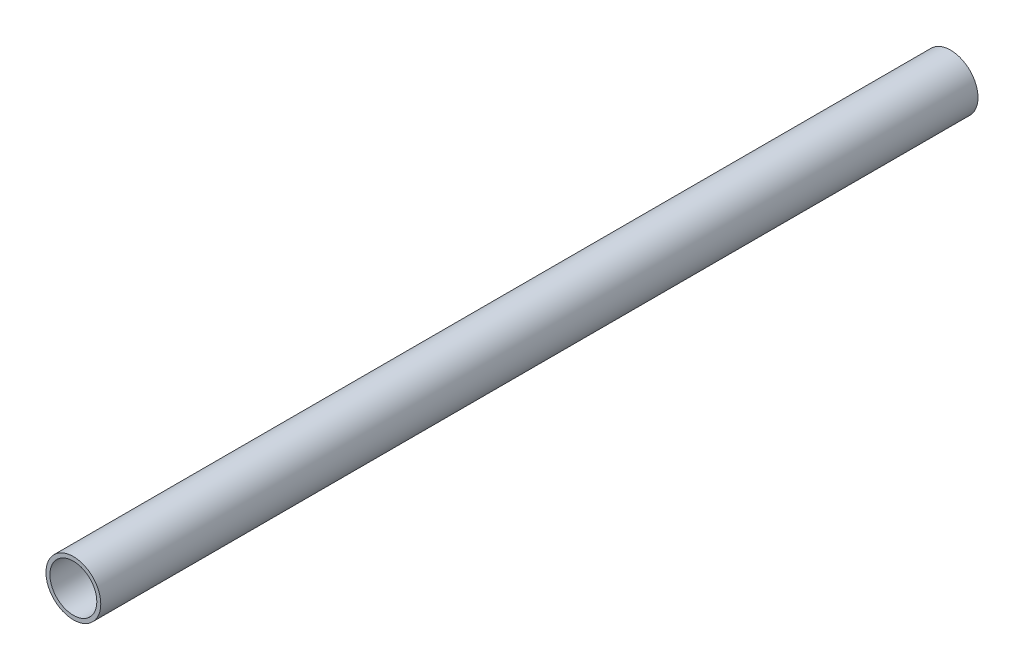
ISO-10303-21;
HEADER;
FILE_DESCRIPTION(('STEP AP214'),'2;1');
FILE_NAME('part.step','',(''),(''),'','','');
FILE_SCHEMA(('AUTOMOTIVE_DESIGN { 1 0 10303 214 1 1 1 1 }'));
ENDSEC;
DATA;
#1=APPLICATION_CONTEXT('core data for automotive mechanical design processes');
#2=APPLICATION_PROTOCOL_DEFINITION('international standard','automotive_design',2000,#1);
#3=PRODUCT_CONTEXT('',#1,'mechanical');
#4=PRODUCT('Part','Part','',(#3));
#5=PRODUCT_RELATED_PRODUCT_CATEGORY('part','',(#4));
#6=PRODUCT_DEFINITION_FORMATION('','',#4);
#7=PRODUCT_DEFINITION_CONTEXT('part definition',#1,'design');
#8=PRODUCT_DEFINITION('design','',#6,#7);
#9=PRODUCT_DEFINITION_SHAPE('','',#8);
#10=(LENGTH_UNIT() NAMED_UNIT(*) SI_UNIT(.MILLI.,.METRE.));
#11=(NAMED_UNIT(*) PLANE_ANGLE_UNIT() SI_UNIT($,.RADIAN.));
#12=(NAMED_UNIT(*) SI_UNIT($,.STERADIAN.) SOLID_ANGLE_UNIT());
#13=UNCERTAINTY_MEASURE_WITH_UNIT(LENGTH_MEASURE(1.E-05),#10,'distance_accuracy_value','');
#14=(GEOMETRIC_REPRESENTATION_CONTEXT(3) GLOBAL_UNCERTAINTY_ASSIGNED_CONTEXT((#13)) GLOBAL_UNIT_ASSIGNED_CONTEXT((#10,
#11,#12)) REPRESENTATION_CONTEXT('',''));
#15=CARTESIAN_POINT('',(0.,0.,0.));
#16=DIRECTION('',(0.,0.,1.));
#17=DIRECTION('',(1.,0.,0.));
#18=AXIS2_PLACEMENT_3D('',#15,#16,#17);
#19=CARTESIAN_POINT('',(0.,0.,50.8));
#20=DIRECTION('',(0.,0.,1.));
#21=DIRECTION('',(1.,0.,0.));
#22=AXIS2_PLACEMENT_3D('',#19,#20,#21);
#23=PLANE('',#22);
#24=CARTESIAN_POINT('',(0.,0.,50.8));
#25=DIRECTION('',(0.,0.,1.));
#26=DIRECTION('',(1.,0.,0.));
#27=AXIS2_PLACEMENT_3D('',#24,#25,#26);
#28=CIRCLE('',#27,1.5875);
#29=CARTESIAN_POINT('',(1.5875,0.,50.8));
#30=VERTEX_POINT('',#29);
#31=EDGE_CURVE('E11',#30,#30,#28,.T.);
#32=ORIENTED_EDGE('',*,*,#31,.T.);
#33=EDGE_LOOP('',(#32));
#34=FACE_BOUND('',#33,.T.);
#35=CARTESIAN_POINT('',(0.,0.,50.8));
#36=DIRECTION('',(0.,0.,1.));
#37=DIRECTION('',(1.,0.,0.));
#38=AXIS2_PLACEMENT_3D('',#35,#36,#37);
#39=CIRCLE('',#38,1.3589);
#40=CARTESIAN_POINT('',(1.3589,0.,50.8));
#41=VERTEX_POINT('',#40);
#42=EDGE_CURVE('E48',#41,#41,#39,.T.);
#43=ORIENTED_EDGE('',*,*,#42,.F.);
#44=EDGE_LOOP('',(#43));
#45=FACE_BOUND('',#44,.T.);
#46=ADVANCED_FACE('F37',(#34,#45),#23,.T.);
#47=CARTESIAN_POINT('',(0.,0.,0.));
#48=DIRECTION('',(0.,0.,1.));
#49=DIRECTION('',(1.,0.,0.));
#50=AXIS2_PLACEMENT_3D('',#47,#48,#49);
#51=PLANE('',#50);
#52=CARTESIAN_POINT('',(0.,0.,0.));
#53=DIRECTION('',(0.,0.,1.));
#54=DIRECTION('',(1.,0.,0.));
#55=AXIS2_PLACEMENT_3D('',#52,#53,#54);
#56=CIRCLE('',#55,1.5875);
#57=CARTESIAN_POINT('',(1.5875,0.,0.));
#58=VERTEX_POINT('',#57);
#59=EDGE_CURVE('E41',#58,#58,#56,.T.);
#60=ORIENTED_EDGE('',*,*,#59,.F.);
#61=EDGE_LOOP('',(#60));
#62=FACE_BOUND('',#61,.T.);
#63=CARTESIAN_POINT('',(0.,0.,0.));
#64=DIRECTION('',(0.,0.,1.));
#65=DIRECTION('',(1.,0.,0.));
#66=AXIS2_PLACEMENT_3D('',#63,#64,#65);
#67=CIRCLE('',#66,1.3589);
#68=CARTESIAN_POINT('',(1.3589,0.,0.));
#69=VERTEX_POINT('',#68);
#70=EDGE_CURVE('E50',#69,#69,#67,.T.);
#71=ORIENTED_EDGE('',*,*,#70,.T.);
#72=EDGE_LOOP('',(#71));
#73=FACE_BOUND('',#72,.T.);
#74=ADVANCED_FACE('F60',(#62,#73),#51,.F.);
#75=CARTESIAN_POINT('',(0.,0.,50.8));
#76=DIRECTION('',(0.,0.,-1.));
#77=DIRECTION('',(-1.,0.,0.));
#78=AXIS2_PLACEMENT_3D('',#75,#76,#77);
#79=CYLINDRICAL_SURFACE('',#78,1.5875);
#80=ORIENTED_EDGE('',*,*,#31,.F.);
#81=EDGE_LOOP('',(#80));
#82=FACE_BOUND('',#81,.T.);
#83=ORIENTED_EDGE('',*,*,#59,.T.);
#84=EDGE_LOOP('',(#83));
#85=FACE_BOUND('',#84,.T.);
#86=ADVANCED_FACE('F39',(#82,#85),#79,.T.);
#87=CARTESIAN_POINT('',(0.,0.,50.8));
#88=DIRECTION('',(0.,0.,-1.));
#89=DIRECTION('',(-1.,0.,0.));
#90=AXIS2_PLACEMENT_3D('',#87,#88,#89);
#91=CYLINDRICAL_SURFACE('',#90,1.3589);
#92=ORIENTED_EDGE('',*,*,#42,.T.);
#93=EDGE_LOOP('',(#92));
#94=FACE_BOUND('',#93,.T.);
#95=ORIENTED_EDGE('',*,*,#70,.F.);
#96=EDGE_LOOP('',(#95));
#97=FACE_BOUND('',#96,.T.);
#98=ADVANCED_FACE('F56',(#94,#97),#91,.F.);
#99=CLOSED_SHELL('',(#46,#74,#86,#98));
#100=MANIFOLD_SOLID_BREP('B2',#99);
#101=ADVANCED_BREP_SHAPE_REPRESENTATION('',(#18,#100),#14);
#102=SHAPE_DEFINITION_REPRESENTATION(#9,#101);
ENDSEC;
END-ISO-10303-21;
